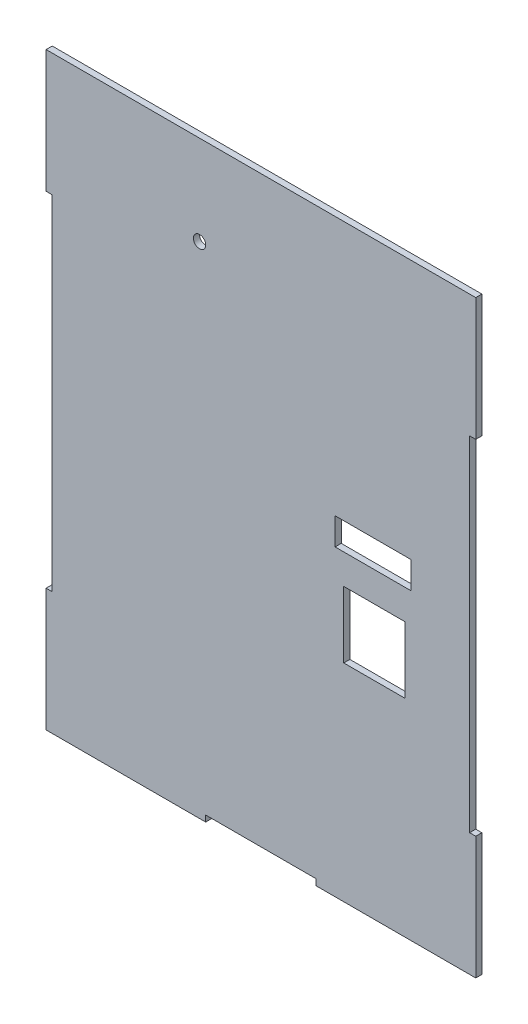
ISO-10303-21;
HEADER;
FILE_DESCRIPTION(('STEP AP214'),'2;1');
FILE_NAME('part.step','',(''),(''),'','','');
FILE_SCHEMA(('AUTOMOTIVE_DESIGN { 1 0 10303 214 1 1 1 1 }'));
ENDSEC;
DATA;
#1=APPLICATION_CONTEXT('core data for automotive mechanical design processes');
#2=APPLICATION_PROTOCOL_DEFINITION('international standard','automotive_design',2000,#1);
#3=PRODUCT_CONTEXT('',#1,'mechanical');
#4=PRODUCT('Part','Part','',(#3));
#5=PRODUCT_RELATED_PRODUCT_CATEGORY('part','',(#4));
#6=PRODUCT_DEFINITION_FORMATION('','',#4);
#7=PRODUCT_DEFINITION_CONTEXT('part definition',#1,'design');
#8=PRODUCT_DEFINITION('design','',#6,#7);
#9=PRODUCT_DEFINITION_SHAPE('','',#8);
#10=(LENGTH_UNIT() NAMED_UNIT(*) SI_UNIT(.MILLI.,.METRE.));
#11=(NAMED_UNIT(*) PLANE_ANGLE_UNIT() SI_UNIT($,.RADIAN.));
#12=(NAMED_UNIT(*) SI_UNIT($,.STERADIAN.) SOLID_ANGLE_UNIT());
#13=UNCERTAINTY_MEASURE_WITH_UNIT(LENGTH_MEASURE(1.E-05),#10,'distance_accuracy_value','');
#14=(GEOMETRIC_REPRESENTATION_CONTEXT(3) GLOBAL_UNCERTAINTY_ASSIGNED_CONTEXT((#13)) GLOBAL_UNIT_ASSIGNED_CONTEXT((#10,
#11,#12)) REPRESENTATION_CONTEXT('',''));
#15=CARTESIAN_POINT('',(0.,0.,0.));
#16=DIRECTION('',(0.,0.,1.));
#17=DIRECTION('',(1.,0.,0.));
#18=AXIS2_PLACEMENT_3D('',#15,#16,#17);
#19=CARTESIAN_POINT('',(0.,0.,6.35));
#20=DIRECTION('',(0.,0.,1.));
#21=DIRECTION('',(1.,0.,0.));
#22=AXIS2_PLACEMENT_3D('',#19,#20,#21);
#23=PLANE('',#22);
#24=CARTESIAN_POINT('',(-292.1,516.89,6.35));
#25=DIRECTION('',(0.,0.,1.));
#26=DIRECTION('',(1.,0.,0.));
#27=AXIS2_PLACEMENT_3D('',#24,#25,#26);
#28=CIRCLE('',#27,6.41350000000002);
#29=CARTESIAN_POINT('',(-285.6865,516.89,6.35));
#30=VERTEX_POINT('',#29);
#31=EDGE_CURVE('E381',#30,#30,#28,.T.);
#32=ORIENTED_EDGE('',*,*,#31,.F.);
#33=EDGE_LOOP('',(#32));
#34=FACE_BOUND('',#33,.T.);
#35=DIRECTION('',(-1.,0.,0.));
#36=VECTOR('',#35,1.);
#37=CARTESIAN_POINT('',(-79.4256243593645,282.577614127339,6.35));
#38=LINE('',#37,#36);
#39=CARTESIAN_POINT('',(-79.4256243593645,282.577614127339,6.35));
#40=VERTEX_POINT('',#39);
#41=CARTESIAN_POINT('',(-142.925624359365,282.577614127339,6.35));
#42=VERTEX_POINT('',#41);
#43=EDGE_CURVE('E274',#40,#42,#38,.T.);
#44=ORIENTED_EDGE('',*,*,#43,.F.);
#45=DIRECTION('',(0.,1.,0.));
#46=VECTOR('',#45,1.);
#47=CARTESIAN_POINT('',(-79.4256243593645,213.997614127338,6.35));
#48=LINE('',#47,#46);
#49=CARTESIAN_POINT('',(-79.4256243593645,213.997614127338,6.35));
#50=VERTEX_POINT('',#49);
#51=EDGE_CURVE('E261',#50,#40,#48,.T.);
#52=ORIENTED_EDGE('',*,*,#51,.F.);
#53=DIRECTION('',(-1.,0.,0.));
#54=VECTOR('',#53,1.);
#55=CARTESIAN_POINT('',(-79.4256243593645,213.997614127338,6.35));
#56=LINE('',#55,#54);
#57=CARTESIAN_POINT('',(-142.925624359365,213.997614127338,6.35));
#58=VERTEX_POINT('',#57);
#59=EDGE_CURVE('E268',#50,#58,#56,.T.);
#60=ORIENTED_EDGE('',*,*,#59,.T.);
#61=DIRECTION('',(0.,1.,0.));
#62=VECTOR('',#61,1.);
#63=CARTESIAN_POINT('',(-142.925624359365,213.997614127338,6.35));
#64=LINE('',#63,#62);
#65=EDGE_CURVE('E271',#58,#42,#64,.T.);
#66=ORIENTED_EDGE('',*,*,#65,.T.);
#67=EDGE_LOOP('',(#44,#52,#60,#66));
#68=FACE_BOUND('',#67,.T.);
#69=DIRECTION('',(-1.,0.,0.));
#70=VECTOR('',#69,1.);
#71=CARTESIAN_POINT('',(-78.193623846538,341.410976048023,6.35));
#72=LINE('',#71,#70);
#73=CARTESIAN_POINT('',(-73.113623846538,341.410976048023,6.35));
#74=VERTEX_POINT('',#73);
#75=CARTESIAN_POINT('',(-151.853623846538,341.410976048023,6.35));
#76=VERTEX_POINT('',#75);
#77=EDGE_CURVE('E294',#74,#76,#72,.T.);
#78=ORIENTED_EDGE('',*,*,#77,.F.);
#79=DIRECTION('',(0.,-1.,0.));
#80=VECTOR('',#79,1.);
#81=CARTESIAN_POINT('',(-73.113623846538,0.,6.35));
#82=LINE('',#81,#80);
#83=CARTESIAN_POINT('',(-73.113623846538,313.470976048023,6.35));
#84=VERTEX_POINT('',#83);
#85=EDGE_CURVE('E296',#74,#84,#82,.T.);
#86=ORIENTED_EDGE('',*,*,#85,.T.);
#87=DIRECTION('',(-1.,0.,0.));
#88=VECTOR('',#87,1.);
#89=CARTESIAN_POINT('',(-78.193623846538,313.470976048023,6.35));
#90=LINE('',#89,#88);
#91=CARTESIAN_POINT('',(-151.853623846538,313.470976048023,6.35));
#92=VERTEX_POINT('',#91);
#93=EDGE_CURVE('E287',#84,#92,#90,.T.);
#94=ORIENTED_EDGE('',*,*,#93,.T.);
#95=DIRECTION('',(0.,1.,0.));
#96=VECTOR('',#95,1.);
#97=CARTESIAN_POINT('',(-151.853623846538,313.470976048023,6.35));
#98=LINE('',#97,#96);
#99=EDGE_CURVE('E291',#92,#76,#98,.T.);
#100=ORIENTED_EDGE('',*,*,#99,.T.);
#101=EDGE_LOOP('',(#78,#86,#94,#100));
#102=FACE_BOUND('',#101,.T.);
#103=DIRECTION('',(1.,0.,0.));
#104=VECTOR('',#103,1.);
#105=CARTESIAN_POINT('',(0.,0.,6.35));
#106=LINE('',#105,#104);
#107=CARTESIAN_POINT('',(-450.85,0.,6.34999999999997));
#108=VERTEX_POINT('',#107);
#109=CARTESIAN_POINT('',(-285.75,0.,6.35));
#110=VERTEX_POINT('',#109);
#111=EDGE_CURVE('E202',#108,#110,#106,.T.);
#112=ORIENTED_EDGE('',*,*,#111,.T.);
#113=DIRECTION('',(0.,1.,0.));
#114=VECTOR('',#113,1.);
#115=CARTESIAN_POINT('',(-285.75,0.,6.35));
#116=LINE('',#115,#114);
#117=CARTESIAN_POINT('',(-285.75,6.34999999999994,6.35));
#118=VERTEX_POINT('',#117);
#119=EDGE_CURVE('E48',#110,#118,#116,.T.);
#120=ORIENTED_EDGE('',*,*,#119,.T.);
#121=DIRECTION('',(1.,0.,0.));
#122=VECTOR('',#121,1.);
#123=CARTESIAN_POINT('',(0.,6.34999999999994,6.35));
#124=LINE('',#123,#122);
#125=CARTESIAN_POINT('',(-171.45,6.34999999999994,6.35));
#126=VERTEX_POINT('',#125);
#127=EDGE_CURVE('E52',#118,#126,#124,.T.);
#128=ORIENTED_EDGE('',*,*,#127,.T.);
#129=DIRECTION('',(0.,-1.,0.));
#130=VECTOR('',#129,1.);
#131=CARTESIAN_POINT('',(-171.45,0.,6.35));
#132=LINE('',#131,#130);
#133=CARTESIAN_POINT('',(-171.45,0.,6.34999999999997));
#134=VERTEX_POINT('',#133);
#135=EDGE_CURVE('E205',#126,#134,#132,.T.);
#136=ORIENTED_EDGE('',*,*,#135,.T.);
#137=CARTESIAN_POINT('',(-6.35,0.,6.34999999999997));
#138=VERTEX_POINT('',#137);
#139=EDGE_CURVE('E193',#134,#138,#106,.T.);
#140=ORIENTED_EDGE('',*,*,#139,.T.);
#141=DIRECTION('',(0.,1.,0.));
#142=VECTOR('',#141,1.);
#143=CARTESIAN_POINT('',(-6.35,0.,6.35));
#144=LINE('',#143,#142);
#145=CARTESIAN_POINT('',(-6.35,127.,6.34999999999997));
#146=VERTEX_POINT('',#145);
#147=EDGE_CURVE('E365',#138,#146,#144,.T.);
#148=ORIENTED_EDGE('',*,*,#147,.T.);
#149=DIRECTION('',(-1.,0.,0.));
#150=VECTOR('',#149,1.);
#151=CARTESIAN_POINT('',(2.77555756156289E-13,127.,6.35));
#152=LINE('',#151,#150);
#153=CARTESIAN_POINT('',(-12.7,127.,6.35));
#154=VERTEX_POINT('',#153);
#155=EDGE_CURVE('E330',#146,#154,#152,.T.);
#156=ORIENTED_EDGE('',*,*,#155,.T.);
#157=DIRECTION('',(0.,1.,0.));
#158=VECTOR('',#157,1.);
#159=CARTESIAN_POINT('',(-12.7,0.,6.35));
#160=LINE('',#159,#158);
#161=CARTESIAN_POINT('',(-12.7,482.6,6.35));
#162=VERTEX_POINT('',#161);
#163=EDGE_CURVE('E323',#154,#162,#160,.T.);
#164=ORIENTED_EDGE('',*,*,#163,.T.);
#165=DIRECTION('',(1.,0.,0.));
#166=VECTOR('',#165,1.);
#167=CARTESIAN_POINT('',(2.1094237467878E-12,482.6,6.35));
#168=LINE('',#167,#166);
#169=CARTESIAN_POINT('',(-6.34999999999999,482.6,6.35));
#170=VERTEX_POINT('',#169);
#171=EDGE_CURVE('E325',#162,#170,#168,.T.);
#172=ORIENTED_EDGE('',*,*,#171,.T.);
#173=DIRECTION('',(0.,-1.,0.));
#174=VECTOR('',#173,1.);
#175=CARTESIAN_POINT('',(-6.34999999999996,0.,6.35));
#176=LINE('',#175,#174);
#177=CARTESIAN_POINT('',(-6.35,609.6,6.35));
#178=VERTEX_POINT('',#177);
#179=EDGE_CURVE('E357',#178,#170,#176,.T.);
#180=ORIENTED_EDGE('',*,*,#179,.F.);
#181=DIRECTION('',(-1.,0.,0.));
#182=VECTOR('',#181,1.);
#183=CARTESIAN_POINT('',(0.,609.6,6.35));
#184=LINE('',#183,#182);
#185=CARTESIAN_POINT('',(-450.85,609.6,6.34999999999997));
#186=VERTEX_POINT('',#185);
#187=EDGE_CURVE('E203',#178,#186,#184,.T.);
#188=ORIENTED_EDGE('',*,*,#187,.T.);
#189=DIRECTION('',(0.,1.,0.));
#190=VECTOR('',#189,1.);
#191=CARTESIAN_POINT('',(-450.85,1.97064586870966E-13,6.35));
#192=LINE('',#191,#190);
#193=CARTESIAN_POINT('',(-450.85,482.6,6.34999999999997));
#194=VERTEX_POINT('',#193);
#195=EDGE_CURVE('E348',#194,#186,#192,.T.);
#196=ORIENTED_EDGE('',*,*,#195,.F.);
#197=DIRECTION('',(-1.,0.,0.));
#198=VECTOR('',#197,1.);
#199=CARTESIAN_POINT('',(0.,482.6,6.35));
#200=LINE('',#199,#198);
#201=CARTESIAN_POINT('',(-444.5,482.6,6.34999999999997));
#202=VERTEX_POINT('',#201);
#203=EDGE_CURVE('E307',#202,#194,#200,.T.);
#204=ORIENTED_EDGE('',*,*,#203,.F.);
#205=DIRECTION('',(0.,1.,0.));
#206=VECTOR('',#205,1.);
#207=CARTESIAN_POINT('',(-444.5,0.,6.35));
#208=LINE('',#207,#206);
#209=CARTESIAN_POINT('',(-444.5,127.,6.34999999999997));
#210=VERTEX_POINT('',#209);
#211=EDGE_CURVE('E305',#210,#202,#208,.T.);
#212=ORIENTED_EDGE('',*,*,#211,.F.);
#213=DIRECTION('',(1.,0.,0.));
#214=VECTOR('',#213,1.);
#215=CARTESIAN_POINT('',(5.55111512312568E-13,126.999999999998,6.35));
#216=LINE('',#215,#214);
#217=CARTESIAN_POINT('',(-450.85,127.,6.35));
#218=VERTEX_POINT('',#217);
#219=EDGE_CURVE('E313',#218,#210,#216,.T.);
#220=ORIENTED_EDGE('',*,*,#219,.F.);
#221=DIRECTION('',(0.,1.,0.));
#222=VECTOR('',#221,1.);
#223=CARTESIAN_POINT('',(-450.85,0.,6.35));
#224=LINE('',#223,#222);
#225=EDGE_CURVE('E340',#108,#218,#224,.T.);
#226=ORIENTED_EDGE('',*,*,#225,.F.);
#227=EDGE_LOOP('',(#112,#120,#128,#136,#140,#148,#156,#164,#172,#180,#188,#196,#204,#212,#220,#226));
#228=FACE_BOUND('',#227,.T.);
#229=ADVANCED_FACE('F33',(#34,#68,#102,#228),#23,.T.);
#230=CARTESIAN_POINT('',(0.,0.,0.));
#231=DIRECTION('',(0.,0.,1.));
#232=DIRECTION('',(1.,0.,0.));
#233=AXIS2_PLACEMENT_3D('',#230,#231,#232);
#234=PLANE('',#233);
#235=CARTESIAN_POINT('',(-292.1,516.89,0.));
#236=DIRECTION('',(0.,0.,1.));
#237=DIRECTION('',(1.,0.,0.));
#238=AXIS2_PLACEMENT_3D('',#235,#236,#237);
#239=CIRCLE('',#238,6.41350000000002);
#240=CARTESIAN_POINT('',(-285.6865,516.89,0.));
#241=VERTEX_POINT('',#240);
#242=EDGE_CURVE('E380',#241,#241,#239,.T.);
#243=ORIENTED_EDGE('',*,*,#242,.T.);
#244=EDGE_LOOP('',(#243));
#245=FACE_BOUND('',#244,.T.);
#246=DIRECTION('',(0.,-1.,0.));
#247=VECTOR('',#246,1.);
#248=CARTESIAN_POINT('',(-73.113623846538,0.,0.));
#249=LINE('',#248,#247);
#250=CARTESIAN_POINT('',(-73.113623846538,341.410976048023,0.));
#251=VERTEX_POINT('',#250);
#252=CARTESIAN_POINT('',(-73.113623846538,313.470976048023,0.));
#253=VERTEX_POINT('',#252);
#254=EDGE_CURVE('E235',#251,#253,#249,.T.);
#255=ORIENTED_EDGE('',*,*,#254,.F.);
#256=DIRECTION('',(-1.,0.,0.));
#257=VECTOR('',#256,1.);
#258=CARTESIAN_POINT('',(0.,341.410976048023,0.));
#259=LINE('',#258,#257);
#260=CARTESIAN_POINT('',(-151.853623846538,341.410976048023,0.));
#261=VERTEX_POINT('',#260);
#262=EDGE_CURVE('E238',#251,#261,#259,.T.);
#263=ORIENTED_EDGE('',*,*,#262,.T.);
#264=DIRECTION('',(0.,1.,0.));
#265=VECTOR('',#264,1.);
#266=CARTESIAN_POINT('',(-151.853623846538,0.,0.));
#267=LINE('',#266,#265);
#268=CARTESIAN_POINT('',(-151.853623846538,313.470976048023,0.));
#269=VERTEX_POINT('',#268);
#270=EDGE_CURVE('E244',#269,#261,#267,.T.);
#271=ORIENTED_EDGE('',*,*,#270,.F.);
#272=DIRECTION('',(-1.,0.,0.));
#273=VECTOR('',#272,1.);
#274=CARTESIAN_POINT('',(0.,313.470976048023,0.));
#275=LINE('',#274,#273);
#276=EDGE_CURVE('E241',#253,#269,#275,.T.);
#277=ORIENTED_EDGE('',*,*,#276,.F.);
#278=EDGE_LOOP('',(#255,#263,#271,#277));
#279=FACE_BOUND('',#278,.T.);
#280=DIRECTION('',(0.,-1.,0.));
#281=VECTOR('',#280,1.);
#282=CARTESIAN_POINT('',(-79.4256243593645,213.997614127338,0.));
#283=LINE('',#282,#281);
#284=CARTESIAN_POINT('',(-79.4256243593645,282.577614127339,0.));
#285=VERTEX_POINT('',#284);
#286=CARTESIAN_POINT('',(-79.4256243593645,213.997614127338,0.));
#287=VERTEX_POINT('',#286);
#288=EDGE_CURVE('E278',#285,#287,#283,.T.);
#289=ORIENTED_EDGE('',*,*,#288,.F.);
#290=DIRECTION('',(1.,0.,0.));
#291=VECTOR('',#290,1.);
#292=CARTESIAN_POINT('',(-79.4256243593645,282.577614127339,0.));
#293=LINE('',#292,#291);
#294=CARTESIAN_POINT('',(-142.925624359365,282.577614127339,0.));
#295=VERTEX_POINT('',#294);
#296=EDGE_CURVE('E276',#295,#285,#293,.T.);
#297=ORIENTED_EDGE('',*,*,#296,.F.);
#298=DIRECTION('',(0.,-1.,0.));
#299=VECTOR('',#298,1.);
#300=CARTESIAN_POINT('',(-142.925624359365,213.997614127338,0.));
#301=LINE('',#300,#299);
#302=CARTESIAN_POINT('',(-142.925624359365,213.997614127338,0.));
#303=VERTEX_POINT('',#302);
#304=EDGE_CURVE('E251',#295,#303,#301,.T.);
#305=ORIENTED_EDGE('',*,*,#304,.T.);
#306=DIRECTION('',(1.,0.,0.));
#307=VECTOR('',#306,1.);
#308=CARTESIAN_POINT('',(-79.4256243593645,213.997614127338,0.));
#309=LINE('',#308,#307);
#310=EDGE_CURVE('E280',#303,#287,#309,.T.);
#311=ORIENTED_EDGE('',*,*,#310,.T.);
#312=EDGE_LOOP('',(#289,#297,#305,#311));
#313=FACE_BOUND('',#312,.T.);
#314=DIRECTION('',(0.,1.,0.));
#315=VECTOR('',#314,1.);
#316=CARTESIAN_POINT('',(-285.75,0.,0.));
#317=LINE('',#316,#315);
#318=CARTESIAN_POINT('',(-285.75,0.,0.));
#319=VERTEX_POINT('',#318);
#320=CARTESIAN_POINT('',(-285.75,6.34999999999994,0.));
#321=VERTEX_POINT('',#320);
#322=EDGE_CURVE('E209',#319,#321,#317,.T.);
#323=ORIENTED_EDGE('',*,*,#322,.F.);
#324=DIRECTION('',(1.,0.,0.));
#325=VECTOR('',#324,1.);
#326=CARTESIAN_POINT('',(0.,0.,0.));
#327=LINE('',#326,#325);
#328=CARTESIAN_POINT('',(-450.85,0.,0.));
#329=VERTEX_POINT('',#328);
#330=EDGE_CURVE('E246',#329,#319,#327,.T.);
#331=ORIENTED_EDGE('',*,*,#330,.F.);
#332=DIRECTION('',(0.,1.,0.));
#333=VECTOR('',#332,1.);
#334=CARTESIAN_POINT('',(-450.85,0.,0.));
#335=LINE('',#334,#333);
#336=CARTESIAN_POINT('',(-450.85,127.,0.));
#337=VERTEX_POINT('',#336);
#338=EDGE_CURVE('E342',#329,#337,#335,.T.);
#339=ORIENTED_EDGE('',*,*,#338,.T.);
#340=DIRECTION('',(1.,0.,0.));
#341=VECTOR('',#340,1.);
#342=CARTESIAN_POINT('',(5.55111512312568E-13,126.999999999998,0.));
#343=LINE('',#342,#341);
#344=CARTESIAN_POINT('',(-444.5,127.,0.));
#345=VERTEX_POINT('',#344);
#346=EDGE_CURVE('E315',#337,#345,#343,.T.);
#347=ORIENTED_EDGE('',*,*,#346,.T.);
#348=DIRECTION('',(0.,1.,0.));
#349=VECTOR('',#348,1.);
#350=CARTESIAN_POINT('',(-444.5,0.,0.));
#351=LINE('',#350,#349);
#352=CARTESIAN_POINT('',(-444.5,482.6,0.));
#353=VERTEX_POINT('',#352);
#354=EDGE_CURVE('E232',#345,#353,#351,.T.);
#355=ORIENTED_EDGE('',*,*,#354,.T.);
#356=DIRECTION('',(-1.,0.,0.));
#357=VECTOR('',#356,1.);
#358=CARTESIAN_POINT('',(0.,482.6,0.));
#359=LINE('',#358,#357);
#360=CARTESIAN_POINT('',(-450.85,482.6,0.));
#361=VERTEX_POINT('',#360);
#362=EDGE_CURVE('E310',#353,#361,#359,.T.);
#363=ORIENTED_EDGE('',*,*,#362,.T.);
#364=DIRECTION('',(0.,1.,0.));
#365=VECTOR('',#364,1.);
#366=CARTESIAN_POINT('',(-450.85,1.97064586870966E-13,0.));
#367=LINE('',#366,#365);
#368=CARTESIAN_POINT('',(-450.85,609.6,0.));
#369=VERTEX_POINT('',#368);
#370=EDGE_CURVE('E351',#361,#369,#367,.T.);
#371=ORIENTED_EDGE('',*,*,#370,.T.);
#372=DIRECTION('',(-1.,0.,0.));
#373=VECTOR('',#372,1.);
#374=CARTESIAN_POINT('',(0.,609.6,0.));
#375=LINE('',#374,#373);
#376=CARTESIAN_POINT('',(-6.35,609.6,0.));
#377=VERTEX_POINT('',#376);
#378=EDGE_CURVE('E250',#377,#369,#375,.T.);
#379=ORIENTED_EDGE('',*,*,#378,.F.);
#380=DIRECTION('',(0.,-1.,0.));
#381=VECTOR('',#380,1.);
#382=CARTESIAN_POINT('',(-6.34999999999996,0.,0.));
#383=LINE('',#382,#381);
#384=CARTESIAN_POINT('',(-6.34999999999999,482.6,0.));
#385=VERTEX_POINT('',#384);
#386=EDGE_CURVE('E360',#377,#385,#383,.T.);
#387=ORIENTED_EDGE('',*,*,#386,.T.);
#388=DIRECTION('',(1.,0.,0.));
#389=VECTOR('',#388,1.);
#390=CARTESIAN_POINT('',(2.1094237467878E-12,482.6,0.));
#391=LINE('',#390,#389);
#392=CARTESIAN_POINT('',(-12.7,482.6,0.));
#393=VERTEX_POINT('',#392);
#394=EDGE_CURVE('E328',#393,#385,#391,.T.);
#395=ORIENTED_EDGE('',*,*,#394,.F.);
#396=DIRECTION('',(0.,1.,0.));
#397=VECTOR('',#396,1.);
#398=CARTESIAN_POINT('',(-12.7,0.,0.));
#399=LINE('',#398,#397);
#400=CARTESIAN_POINT('',(-12.7,127.,0.));
#401=VERTEX_POINT('',#400);
#402=EDGE_CURVE('E229',#401,#393,#399,.T.);
#403=ORIENTED_EDGE('',*,*,#402,.F.);
#404=DIRECTION('',(-1.,0.,0.));
#405=VECTOR('',#404,1.);
#406=CARTESIAN_POINT('',(2.77555756156289E-13,127.,0.));
#407=LINE('',#406,#405);
#408=CARTESIAN_POINT('',(-6.35,127.,0.));
#409=VERTEX_POINT('',#408);
#410=EDGE_CURVE('E332',#409,#401,#407,.T.);
#411=ORIENTED_EDGE('',*,*,#410,.F.);
#412=DIRECTION('',(0.,1.,0.));
#413=VECTOR('',#412,1.);
#414=CARTESIAN_POINT('',(-6.35,0.,0.));
#415=LINE('',#414,#413);
#416=CARTESIAN_POINT('',(-6.35,0.,0.));
#417=VERTEX_POINT('',#416);
#418=EDGE_CURVE('E367',#417,#409,#415,.T.);
#419=ORIENTED_EDGE('',*,*,#418,.F.);
#420=CARTESIAN_POINT('',(-171.45,0.,0.));
#421=VERTEX_POINT('',#420);
#422=EDGE_CURVE('E249',#421,#417,#327,.T.);
#423=ORIENTED_EDGE('',*,*,#422,.F.);
#424=DIRECTION('',(0.,-1.,0.));
#425=VECTOR('',#424,1.);
#426=CARTESIAN_POINT('',(-171.45,0.,0.));
#427=LINE('',#426,#425);
#428=CARTESIAN_POINT('',(-171.45,6.34999999999994,0.));
#429=VERTEX_POINT('',#428);
#430=EDGE_CURVE('E210',#429,#421,#427,.T.);
#431=ORIENTED_EDGE('',*,*,#430,.F.);
#432=DIRECTION('',(1.,0.,0.));
#433=VECTOR('',#432,1.);
#434=CARTESIAN_POINT('',(0.,6.34999999999994,0.));
#435=LINE('',#434,#433);
#436=EDGE_CURVE('E11',#321,#429,#435,.T.);
#437=ORIENTED_EDGE('',*,*,#436,.F.);
#438=EDGE_LOOP('',(#323,#331,#339,#347,#355,#363,#371,#379,#387,#395,#403,#411,#419,#423,#431,#437));
#439=FACE_BOUND('',#438,.T.);
#440=ADVANCED_FACE('F387',(#245,#279,#313,#439),#234,.F.);
#441=CARTESIAN_POINT('',(0.,0.,6.35));
#442=DIRECTION('',(0.,1.,0.));
#443=DIRECTION('',(-1.,0.,0.));
#444=AXIS2_PLACEMENT_3D('',#441,#442,#443);
#445=PLANE('',#444);
#446=DIRECTION('',(0.,0.,-1.));
#447=VECTOR('',#446,1.);
#448=CARTESIAN_POINT('',(-285.75,0.,6.35));
#449=LINE('',#448,#447);
#450=EDGE_CURVE('E41',#110,#319,#449,.T.);
#451=ORIENTED_EDGE('',*,*,#450,.F.);
#452=ORIENTED_EDGE('',*,*,#111,.F.);
#453=DIRECTION('',(0.,0.,-1.));
#454=VECTOR('',#453,1.);
#455=CARTESIAN_POINT('',(-450.85,0.,958.883072342504));
#456=LINE('',#455,#454);
#457=EDGE_CURVE('E345',#108,#329,#456,.T.);
#458=ORIENTED_EDGE('',*,*,#457,.T.);
#459=ORIENTED_EDGE('',*,*,#330,.T.);
#460=EDGE_LOOP('',(#451,#452,#458,#459));
#461=FACE_BOUND('',#460,.T.);
#462=ADVANCED_FACE('F447',(#461),#445,.F.);
#463=DIRECTION('',(0.,0.,1.));
#464=VECTOR('',#463,1.);
#465=CARTESIAN_POINT('',(-171.45,0.,6.35));
#466=LINE('',#465,#464);
#467=EDGE_CURVE('E196',#421,#134,#466,.T.);
#468=ORIENTED_EDGE('',*,*,#467,.F.);
#469=ORIENTED_EDGE('',*,*,#422,.T.);
#470=DIRECTION('',(0.,0.,-1.));
#471=VECTOR('',#470,1.);
#472=CARTESIAN_POINT('',(-6.35,0.,954.142010576424));
#473=LINE('',#472,#471);
#474=EDGE_CURVE('E199',#138,#417,#473,.T.);
#475=ORIENTED_EDGE('',*,*,#474,.F.);
#476=ORIENTED_EDGE('',*,*,#139,.F.);
#477=EDGE_LOOP('',(#468,#469,#475,#476));
#478=FACE_BOUND('',#477,.T.);
#479=ADVANCED_FACE('F194',(#478),#445,.F.);
#480=CARTESIAN_POINT('',(-12.7,127.,966.820572342504));
#481=DIRECTION('',(0.,1.,0.));
#482=DIRECTION('',(-1.,0.,0.));
#483=AXIS2_PLACEMENT_3D('',#480,#481,#482);
#484=PLANE('',#483);
#485=ORIENTED_EDGE('',*,*,#155,.F.);
#486=DIRECTION('',(0.,0.,-1.));
#487=VECTOR('',#486,1.);
#488=CARTESIAN_POINT('',(-6.35,127.,966.820572342504));
#489=LINE('',#488,#487);
#490=EDGE_CURVE('E214',#146,#409,#489,.T.);
#491=ORIENTED_EDGE('',*,*,#490,.T.);
#492=ORIENTED_EDGE('',*,*,#410,.T.);
#493=DIRECTION('',(0.,0.,-1.));
#494=VECTOR('',#493,1.);
#495=CARTESIAN_POINT('',(-12.7,127.,966.820572342504));
#496=LINE('',#495,#494);
#497=EDGE_CURVE('E337',#154,#401,#496,.T.);
#498=ORIENTED_EDGE('',*,*,#497,.F.);
#499=EDGE_LOOP('',(#485,#491,#492,#498));
#500=FACE_BOUND('',#499,.T.);
#501=ADVANCED_FACE('F453',(#500),#484,.T.);
#502=CARTESIAN_POINT('',(0.,609.6,6.35));
#503=DIRECTION('',(0.,-1.,0.));
#504=DIRECTION('',(1.,0.,0.));
#505=AXIS2_PLACEMENT_3D('',#502,#503,#504);
#506=PLANE('',#505);
#507=ORIENTED_EDGE('',*,*,#187,.F.);
#508=DIRECTION('',(0.,0.,-1.));
#509=VECTOR('',#508,1.);
#510=CARTESIAN_POINT('',(-6.35,609.6,954.142010576424));
#511=LINE('',#510,#509);
#512=EDGE_CURVE('E363',#178,#377,#511,.T.);
#513=ORIENTED_EDGE('',*,*,#512,.T.);
#514=ORIENTED_EDGE('',*,*,#378,.T.);
#515=DIRECTION('',(0.,0.,-1.));
#516=VECTOR('',#515,1.);
#517=CARTESIAN_POINT('',(-450.85,609.6,958.883072342504));
#518=LINE('',#517,#516);
#519=EDGE_CURVE('E354',#186,#369,#518,.T.);
#520=ORIENTED_EDGE('',*,*,#519,.F.);
#521=EDGE_LOOP('',(#507,#513,#514,#520));
#522=FACE_BOUND('',#521,.T.);
#523=ADVANCED_FACE('F35',(#522),#506,.F.);
#524=CARTESIAN_POINT('',(-79.4256243593645,282.577614127339,-0.00100000000000013));
#525=DIRECTION('',(0.,1.,0.));
#526=DIRECTION('',(0.,0.,1.));
#527=AXIS2_PLACEMENT_3D('',#524,#525,#526);
#528=PLANE('',#527);
#529=ORIENTED_EDGE('',*,*,#296,.T.);
#530=DIRECTION('',(0.,0.,1.));
#531=VECTOR('',#530,1.);
#532=CARTESIAN_POINT('',(-79.4256243593645,282.577614127339,-0.00100000000000013));
#533=LINE('',#532,#531);
#534=EDGE_CURVE('E256',#285,#40,#533,.T.);
#535=ORIENTED_EDGE('',*,*,#534,.T.);
#536=ORIENTED_EDGE('',*,*,#43,.T.);
#537=DIRECTION('',(0.,0.,1.));
#538=VECTOR('',#537,1.);
#539=CARTESIAN_POINT('',(-142.925624359365,282.577614127339,-0.00100000000000013));
#540=LINE('',#539,#538);
#541=EDGE_CURVE('E257',#295,#42,#540,.T.);
#542=ORIENTED_EDGE('',*,*,#541,.F.);
#543=EDGE_LOOP('',(#529,#535,#536,#542));
#544=FACE_BOUND('',#543,.T.);
#545=ADVANCED_FACE('F435',(#544),#528,.F.);
#546=CARTESIAN_POINT('',(-79.4256243593645,213.997614127338,-0.00100000000000013));
#547=DIRECTION('',(1.,0.,0.));
#548=DIRECTION('',(0.,0.,-1.));
#549=AXIS2_PLACEMENT_3D('',#546,#547,#548);
#550=PLANE('',#549);
#551=ORIENTED_EDGE('',*,*,#288,.T.);
#552=DIRECTION('',(0.,0.,1.));
#553=VECTOR('',#552,1.);
#554=CARTESIAN_POINT('',(-79.4256243593645,213.997614127338,-0.00100000000000013));
#555=LINE('',#554,#553);
#556=EDGE_CURVE('E263',#287,#50,#555,.T.);
#557=ORIENTED_EDGE('',*,*,#556,.T.);
#558=ORIENTED_EDGE('',*,*,#51,.T.);
#559=ORIENTED_EDGE('',*,*,#534,.F.);
#560=EDGE_LOOP('',(#551,#557,#558,#559));
#561=FACE_BOUND('',#560,.T.);
#562=ADVANCED_FACE('F431',(#561),#550,.F.);
#563=CARTESIAN_POINT('',(-79.4256243593645,213.997614127338,-0.00100000000000013));
#564=DIRECTION('',(0.,1.,0.));
#565=DIRECTION('',(0.,0.,1.));
#566=AXIS2_PLACEMENT_3D('',#563,#564,#565);
#567=PLANE('',#566);
#568=DIRECTION('',(0.,0.,1.));
#569=VECTOR('',#568,1.);
#570=CARTESIAN_POINT('',(-142.925624359365,213.997614127338,-0.00100000000000013));
#571=LINE('',#570,#569);
#572=EDGE_CURVE('E260',#303,#58,#571,.T.);
#573=ORIENTED_EDGE('',*,*,#572,.T.);
#574=ORIENTED_EDGE('',*,*,#59,.F.);
#575=ORIENTED_EDGE('',*,*,#556,.F.);
#576=ORIENTED_EDGE('',*,*,#310,.F.);
#577=EDGE_LOOP('',(#573,#574,#575,#576));
#578=FACE_BOUND('',#577,.T.);
#579=ADVANCED_FACE('F434',(#578),#567,.T.);
#580=CARTESIAN_POINT('',(-142.925624359365,213.997614127338,-0.00100000000000013));
#581=DIRECTION('',(1.,0.,0.));
#582=DIRECTION('',(0.,0.,-1.));
#583=AXIS2_PLACEMENT_3D('',#580,#581,#582);
#584=PLANE('',#583);
#585=ORIENTED_EDGE('',*,*,#541,.T.);
#586=ORIENTED_EDGE('',*,*,#65,.F.);
#587=ORIENTED_EDGE('',*,*,#572,.F.);
#588=ORIENTED_EDGE('',*,*,#304,.F.);
#589=EDGE_LOOP('',(#585,#586,#587,#588));
#590=FACE_BOUND('',#589,.T.);
#591=ADVANCED_FACE('F430',(#590),#584,.T.);
#592=CARTESIAN_POINT('',(-78.193623846538,341.410976048023,-57.15));
#593=DIRECTION('',(0.,1.,0.));
#594=DIRECTION('',(0.,0.,1.));
#595=AXIS2_PLACEMENT_3D('',#592,#593,#594);
#596=PLANE('',#595);
#597=ORIENTED_EDGE('',*,*,#262,.F.);
#598=DIRECTION('',(0.,0.,-1.));
#599=VECTOR('',#598,1.);
#600=CARTESIAN_POINT('',(-73.113623846538,341.410976048023,966.820572342504));
#601=LINE('',#600,#599);
#602=EDGE_CURVE('E299',#74,#251,#601,.T.);
#603=ORIENTED_EDGE('',*,*,#602,.F.);
#604=ORIENTED_EDGE('',*,*,#77,.T.);
#605=DIRECTION('',(0.,0.,1.));
#606=VECTOR('',#605,1.);
#607=CARTESIAN_POINT('',(-151.853623846538,341.410976048023,-57.15));
#608=LINE('',#607,#606);
#609=EDGE_CURVE('E284',#261,#76,#608,.T.);
#610=ORIENTED_EDGE('',*,*,#609,.F.);
#611=EDGE_LOOP('',(#597,#603,#604,#610));
#612=FACE_BOUND('',#611,.T.);
#613=ADVANCED_FACE('F410',(#612),#596,.F.);
#614=CARTESIAN_POINT('',(-78.193623846538,313.470976048023,-57.15));
#615=DIRECTION('',(0.,1.,0.));
#616=DIRECTION('',(0.,0.,1.));
#617=AXIS2_PLACEMENT_3D('',#614,#615,#616);
#618=PLANE('',#617);
#619=ORIENTED_EDGE('',*,*,#276,.T.);
#620=DIRECTION('',(0.,0.,1.));
#621=VECTOR('',#620,1.);
#622=CARTESIAN_POINT('',(-151.853623846538,313.470976048023,-57.15));
#623=LINE('',#622,#621);
#624=EDGE_CURVE('E283',#269,#92,#623,.T.);
#625=ORIENTED_EDGE('',*,*,#624,.T.);
#626=ORIENTED_EDGE('',*,*,#93,.F.);
#627=DIRECTION('',(0.,0.,-1.));
#628=VECTOR('',#627,1.);
#629=CARTESIAN_POINT('',(-73.113623846538,313.470976048023,966.820572342504));
#630=LINE('',#629,#628);
#631=EDGE_CURVE('E302',#84,#253,#630,.T.);
#632=ORIENTED_EDGE('',*,*,#631,.T.);
#633=EDGE_LOOP('',(#619,#625,#626,#632));
#634=FACE_BOUND('',#633,.T.);
#635=ADVANCED_FACE('F415',(#634),#618,.T.);
#636=CARTESIAN_POINT('',(-151.853623846538,313.470976048023,-57.15));
#637=DIRECTION('',(1.,0.,0.));
#638=DIRECTION('',(0.,0.,-1.));
#639=AXIS2_PLACEMENT_3D('',#636,#637,#638);
#640=PLANE('',#639);
#641=ORIENTED_EDGE('',*,*,#270,.T.);
#642=ORIENTED_EDGE('',*,*,#609,.T.);
#643=ORIENTED_EDGE('',*,*,#99,.F.);
#644=ORIENTED_EDGE('',*,*,#624,.F.);
#645=EDGE_LOOP('',(#641,#642,#643,#644));
#646=FACE_BOUND('',#645,.T.);
#647=ADVANCED_FACE('F417',(#646),#640,.T.);
#648=CARTESIAN_POINT('',(-73.113623846538,313.470976048023,966.820572342504));
#649=DIRECTION('',(-1.,0.,0.));
#650=DIRECTION('',(0.,0.,1.));
#651=AXIS2_PLACEMENT_3D('',#648,#649,#650);
#652=PLANE('',#651);
#653=ORIENTED_EDGE('',*,*,#85,.F.);
#654=ORIENTED_EDGE('',*,*,#602,.T.);
#655=ORIENTED_EDGE('',*,*,#254,.T.);
#656=ORIENTED_EDGE('',*,*,#631,.F.);
#657=EDGE_LOOP('',(#653,#654,#655,#656));
#658=FACE_BOUND('',#657,.T.);
#659=ADVANCED_FACE('F409',(#658),#652,.T.);
#660=CARTESIAN_POINT('',(-444.5,482.6,958.883072342504));
#661=DIRECTION('',(1.,0.,0.));
#662=DIRECTION('',(0.,0.,-1.));
#663=AXIS2_PLACEMENT_3D('',#660,#661,#662);
#664=PLANE('',#663);
#665=DIRECTION('',(0.,0.,-1.));
#666=VECTOR('',#665,1.);
#667=CARTESIAN_POINT('',(-444.5,127.,958.883072342504));
#668=LINE('',#667,#666);
#669=EDGE_CURVE('E320',#210,#345,#668,.T.);
#670=ORIENTED_EDGE('',*,*,#669,.F.);
#671=ORIENTED_EDGE('',*,*,#211,.T.);
#672=DIRECTION('',(0.,0.,-1.));
#673=VECTOR('',#672,1.);
#674=CARTESIAN_POINT('',(-444.5,482.6,958.883072342504));
#675=LINE('',#674,#673);
#676=EDGE_CURVE('E317',#202,#353,#675,.T.);
#677=ORIENTED_EDGE('',*,*,#676,.T.);
#678=ORIENTED_EDGE('',*,*,#354,.F.);
#679=EDGE_LOOP('',(#670,#671,#677,#678));
#680=FACE_BOUND('',#679,.T.);
#681=ADVANCED_FACE('F424',(#680),#664,.F.);
#682=CARTESIAN_POINT('',(-444.5,482.6,958.883072342504));
#683=DIRECTION('',(0.,1.,0.));
#684=DIRECTION('',(0.,0.,1.));
#685=AXIS2_PLACEMENT_3D('',#682,#683,#684);
#686=PLANE('',#685);
#687=ORIENTED_EDGE('',*,*,#203,.T.);
#688=DIRECTION('',(0.,0.,-1.));
#689=VECTOR('',#688,1.);
#690=CARTESIAN_POINT('',(-450.85,482.6,958.883072342504));
#691=LINE('',#690,#689);
#692=EDGE_CURVE('E223',#194,#361,#691,.T.);
#693=ORIENTED_EDGE('',*,*,#692,.T.);
#694=ORIENTED_EDGE('',*,*,#362,.F.);
#695=ORIENTED_EDGE('',*,*,#676,.F.);
#696=EDGE_LOOP('',(#687,#693,#694,#695));
#697=FACE_BOUND('',#696,.T.);
#698=ADVANCED_FACE('F493',(#697),#686,.F.);
#699=CARTESIAN_POINT('',(-444.5,127.,958.883072342504));
#700=DIRECTION('',(0.,-1.,0.));
#701=DIRECTION('',(1.,0.,0.));
#702=AXIS2_PLACEMENT_3D('',#699,#700,#701);
#703=PLANE('',#702);
#704=ORIENTED_EDGE('',*,*,#346,.F.);
#705=DIRECTION('',(0.,0.,1.));
#706=VECTOR('',#705,1.);
#707=CARTESIAN_POINT('',(-450.85,127.,958.883072342504));
#708=LINE('',#707,#706);
#709=EDGE_CURVE('E226',#337,#218,#708,.T.);
#710=ORIENTED_EDGE('',*,*,#709,.T.);
#711=ORIENTED_EDGE('',*,*,#219,.T.);
#712=ORIENTED_EDGE('',*,*,#669,.T.);
#713=EDGE_LOOP('',(#704,#710,#711,#712));
#714=FACE_BOUND('',#713,.T.);
#715=ADVANCED_FACE('F500',(#714),#703,.F.);
#716=CARTESIAN_POINT('',(-12.7,482.6,966.820572342504));
#717=DIRECTION('',(1.,0.,0.));
#718=DIRECTION('',(0.,1.,0.));
#719=AXIS2_PLACEMENT_3D('',#716,#717,#718);
#720=PLANE('',#719);
#721=ORIENTED_EDGE('',*,*,#163,.F.);
#722=ORIENTED_EDGE('',*,*,#497,.T.);
#723=ORIENTED_EDGE('',*,*,#402,.T.);
#724=DIRECTION('',(0.,0.,-1.));
#725=VECTOR('',#724,1.);
#726=CARTESIAN_POINT('',(-12.7,482.6,966.820572342504));
#727=LINE('',#726,#725);
#728=EDGE_CURVE('E334',#162,#393,#727,.T.);
#729=ORIENTED_EDGE('',*,*,#728,.F.);
#730=EDGE_LOOP('',(#721,#722,#723,#729));
#731=FACE_BOUND('',#730,.T.);
#732=ADVANCED_FACE('F474',(#731),#720,.T.);
#733=CARTESIAN_POINT('',(-12.7,482.6,966.820572342504));
#734=DIRECTION('',(0.,-1.,0.));
#735=DIRECTION('',(1.,0.,0.));
#736=AXIS2_PLACEMENT_3D('',#733,#734,#735);
#737=PLANE('',#736);
#738=DIRECTION('',(0.,0.,-1.));
#739=VECTOR('',#738,1.);
#740=CARTESIAN_POINT('',(-6.34999999999999,482.6,966.820572342504));
#741=LINE('',#740,#739);
#742=EDGE_CURVE('E218',#170,#385,#741,.T.);
#743=ORIENTED_EDGE('',*,*,#742,.F.);
#744=ORIENTED_EDGE('',*,*,#171,.F.);
#745=ORIENTED_EDGE('',*,*,#728,.T.);
#746=ORIENTED_EDGE('',*,*,#394,.T.);
#747=EDGE_LOOP('',(#743,#744,#745,#746));
#748=FACE_BOUND('',#747,.T.);
#749=ADVANCED_FACE('F478',(#748),#737,.T.);
#750=CARTESIAN_POINT('',(-450.85,127.,958.883072342504));
#751=DIRECTION('',(1.,0.,0.));
#752=DIRECTION('',(0.,0.,-1.));
#753=AXIS2_PLACEMENT_3D('',#750,#751,#752);
#754=PLANE('',#753);
#755=ORIENTED_EDGE('',*,*,#457,.F.);
#756=ORIENTED_EDGE('',*,*,#225,.T.);
#757=ORIENTED_EDGE('',*,*,#709,.F.);
#758=ORIENTED_EDGE('',*,*,#338,.F.);
#759=EDGE_LOOP('',(#755,#756,#757,#758));
#760=FACE_BOUND('',#759,.T.);
#761=ADVANCED_FACE('F502',(#760),#754,.F.);
#762=CARTESIAN_POINT('',(-450.85,609.6,958.883072342504));
#763=DIRECTION('',(1.,0.,0.));
#764=DIRECTION('',(0.,1.,0.));
#765=AXIS2_PLACEMENT_3D('',#762,#763,#764);
#766=PLANE('',#765);
#767=ORIENTED_EDGE('',*,*,#692,.F.);
#768=ORIENTED_EDGE('',*,*,#195,.T.);
#769=ORIENTED_EDGE('',*,*,#519,.T.);
#770=ORIENTED_EDGE('',*,*,#370,.F.);
#771=EDGE_LOOP('',(#767,#768,#769,#770));
#772=FACE_BOUND('',#771,.T.);
#773=ADVANCED_FACE('F489',(#772),#766,.F.);
#774=CARTESIAN_POINT('',(-6.34999999999999,482.6,954.142010576424));
#775=DIRECTION('',(-1.,0.,0.));
#776=DIRECTION('',(0.,-1.,0.));
#777=AXIS2_PLACEMENT_3D('',#774,#775,#776);
#778=PLANE('',#777);
#779=ORIENTED_EDGE('',*,*,#512,.F.);
#780=ORIENTED_EDGE('',*,*,#179,.T.);
#781=ORIENTED_EDGE('',*,*,#742,.T.);
#782=ORIENTED_EDGE('',*,*,#386,.F.);
#783=EDGE_LOOP('',(#779,#780,#781,#782));
#784=FACE_BOUND('',#783,.T.);
#785=ADVANCED_FACE('F482',(#784),#778,.F.);
#786=CARTESIAN_POINT('',(-6.35,127.,954.142010576424));
#787=DIRECTION('',(1.,0.,0.));
#788=DIRECTION('',(0.,1.,0.));
#789=AXIS2_PLACEMENT_3D('',#786,#787,#788);
#790=PLANE('',#789);
#791=ORIENTED_EDGE('',*,*,#147,.F.);
#792=ORIENTED_EDGE('',*,*,#474,.T.);
#793=ORIENTED_EDGE('',*,*,#418,.T.);
#794=ORIENTED_EDGE('',*,*,#490,.F.);
#795=EDGE_LOOP('',(#791,#792,#793,#794));
#796=FACE_BOUND('',#795,.T.);
#797=ADVANCED_FACE('F467',(#796),#790,.T.);
#798=CARTESIAN_POINT('',(-285.75,6.34999999999994,949.44392137329));
#799=DIRECTION('',(0.,-1.,0.));
#800=DIRECTION('',(0.,0.,-1.));
#801=AXIS2_PLACEMENT_3D('',#798,#799,#800);
#802=PLANE('',#801);
#803=ORIENTED_EDGE('',*,*,#127,.F.);
#804=DIRECTION('',(0.,0.,-1.));
#805=VECTOR('',#804,1.);
#806=CARTESIAN_POINT('',(-285.75,6.34999999999994,949.44392137329));
#807=LINE('',#806,#805);
#808=EDGE_CURVE('E375',#118,#321,#807,.T.);
#809=ORIENTED_EDGE('',*,*,#808,.T.);
#810=ORIENTED_EDGE('',*,*,#436,.T.);
#811=DIRECTION('',(0.,0.,-1.));
#812=VECTOR('',#811,1.);
#813=CARTESIAN_POINT('',(-171.45,6.34999999999994,949.44392137329));
#814=LINE('',#813,#812);
#815=EDGE_CURVE('E378',#126,#429,#814,.T.);
#816=ORIENTED_EDGE('',*,*,#815,.F.);
#817=EDGE_LOOP('',(#803,#809,#810,#816));
#818=FACE_BOUND('',#817,.T.);
#819=ADVANCED_FACE('F462',(#818),#802,.T.);
#820=CARTESIAN_POINT('',(-285.75,6.34999999999994,949.44392137329));
#821=DIRECTION('',(1.,0.,0.));
#822=DIRECTION('',(0.,0.,-1.));
#823=AXIS2_PLACEMENT_3D('',#820,#821,#822);
#824=PLANE('',#823);
#825=ORIENTED_EDGE('',*,*,#119,.F.);
#826=ORIENTED_EDGE('',*,*,#450,.T.);
#827=ORIENTED_EDGE('',*,*,#322,.T.);
#828=ORIENTED_EDGE('',*,*,#808,.F.);
#829=EDGE_LOOP('',(#825,#826,#827,#828));
#830=FACE_BOUND('',#829,.T.);
#831=ADVANCED_FACE('F460',(#830),#824,.T.);
#832=CARTESIAN_POINT('',(-171.45,6.34999999999994,949.44392137329));
#833=DIRECTION('',(-1.,0.,0.));
#834=DIRECTION('',(0.,0.,1.));
#835=AXIS2_PLACEMENT_3D('',#832,#833,#834);
#836=PLANE('',#835);
#837=ORIENTED_EDGE('',*,*,#135,.F.);
#838=ORIENTED_EDGE('',*,*,#815,.T.);
#839=ORIENTED_EDGE('',*,*,#430,.T.);
#840=ORIENTED_EDGE('',*,*,#467,.T.);
#841=EDGE_LOOP('',(#837,#838,#839,#840));
#842=FACE_BOUND('',#841,.T.);
#843=ADVANCED_FACE('F213',(#842),#836,.T.);
#844=CARTESIAN_POINT('',(-292.1,516.89,0.));
#845=DIRECTION('',(0.,0.,1.));
#846=DIRECTION('',(1.,0.,0.));
#847=AXIS2_PLACEMENT_3D('',#844,#845,#846);
#848=CYLINDRICAL_SURFACE('',#847,6.41350000000002);
#849=ORIENTED_EDGE('',*,*,#242,.F.);
#850=EDGE_LOOP('',(#849));
#851=FACE_BOUND('',#850,.T.);
#852=ORIENTED_EDGE('',*,*,#31,.T.);
#853=EDGE_LOOP('',(#852));
#854=FACE_BOUND('',#853,.T.);
#855=ADVANCED_FACE('F390',(#851,#854),#848,.F.);
#856=CLOSED_SHELL('',(#229,#440,#462,#479,#501,#523,#545,#562,#579,#591,#613,#635,#647,#659,
#681,#698,#715,#732,#749,#761,#773,#785,#797,#819,#831,#843,#855));
#857=MANIFOLD_SOLID_BREP('B2',#856);
#858=ADVANCED_BREP_SHAPE_REPRESENTATION('',(#18,#857),#14);
#859=SHAPE_DEFINITION_REPRESENTATION(#9,#858);
ENDSEC;
END-ISO-10303-21;
